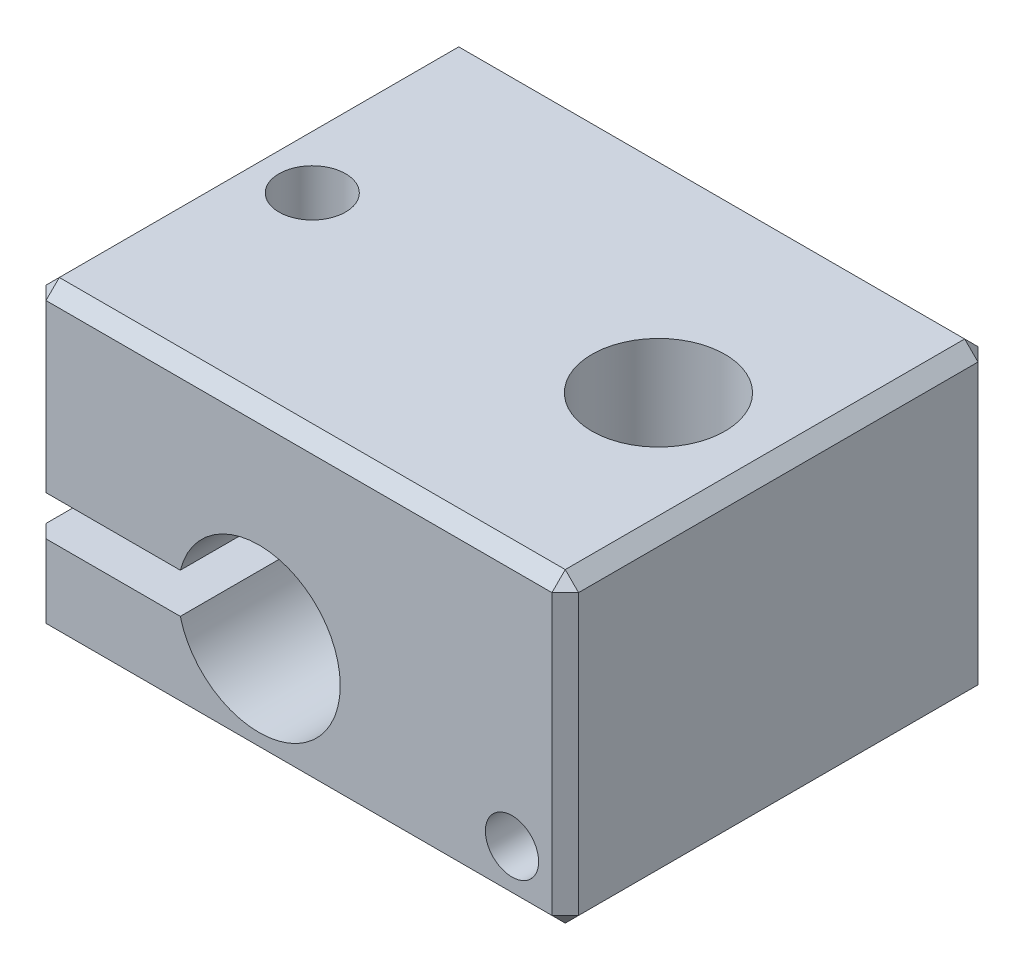
ISO-10303-21;
HEADER;
FILE_DESCRIPTION(('STEP AP214'),'2;1');
FILE_NAME('part.step','',(''),(''),'','','');
FILE_SCHEMA(('AUTOMOTIVE_DESIGN { 1 0 10303 214 1 1 1 1 }'));
ENDSEC;
DATA;
#1=APPLICATION_CONTEXT('core data for automotive mechanical design processes');
#2=APPLICATION_PROTOCOL_DEFINITION('international standard','automotive_design',2000,#1);
#3=PRODUCT_CONTEXT('',#1,'mechanical');
#4=PRODUCT('Part','Part','',(#3));
#5=PRODUCT_RELATED_PRODUCT_CATEGORY('part','',(#4));
#6=PRODUCT_DEFINITION_FORMATION('','',#4);
#7=PRODUCT_DEFINITION_CONTEXT('part definition',#1,'design');
#8=PRODUCT_DEFINITION('design','',#6,#7);
#9=PRODUCT_DEFINITION_SHAPE('','',#8);
#10=(LENGTH_UNIT() NAMED_UNIT(*) SI_UNIT(.MILLI.,.METRE.));
#11=(NAMED_UNIT(*) PLANE_ANGLE_UNIT() SI_UNIT($,.RADIAN.));
#12=(NAMED_UNIT(*) SI_UNIT($,.STERADIAN.) SOLID_ANGLE_UNIT());
#13=UNCERTAINTY_MEASURE_WITH_UNIT(LENGTH_MEASURE(1.E-05),#10,'distance_accuracy_value','');
#14=(GEOMETRIC_REPRESENTATION_CONTEXT(3) GLOBAL_UNCERTAINTY_ASSIGNED_CONTEXT((#13)) GLOBAL_UNIT_ASSIGNED_CONTEXT((#10,
#11,#12)) REPRESENTATION_CONTEXT('',''));
#15=CARTESIAN_POINT('',(0.,0.,0.));
#16=DIRECTION('',(0.,0.,1.));
#17=DIRECTION('',(1.,0.,0.));
#18=AXIS2_PLACEMENT_3D('',#15,#16,#17);
#19=CARTESIAN_POINT('',(0.,11.5,0.));
#20=DIRECTION('',(1.,0.,0.));
#21=DIRECTION('',(0.,0.,-1.));
#22=AXIS2_PLACEMENT_3D('',#19,#20,#21);
#23=PLANE('',#22);
#24=DIRECTION('',(0.,0.,-1.));
#25=VECTOR('',#24,1.);
#26=CARTESIAN_POINT('',(0.,11.,0.));
#27=LINE('',#26,#25);
#28=CARTESIAN_POINT('',(0.,11.,-0.500000000000004));
#29=VERTEX_POINT('',#28);
#30=CARTESIAN_POINT('',(0.,11.,-15.5));
#31=VERTEX_POINT('',#30);
#32=EDGE_CURVE('E297',#29,#31,#27,.T.);
#33=ORIENTED_EDGE('',*,*,#32,.T.);
#34=DIRECTION('',(0.,-1.,0.));
#35=VECTOR('',#34,1.);
#36=CARTESIAN_POINT('',(0.,11.5,-15.5));
#37=LINE('',#36,#35);
#38=CARTESIAN_POINT('',(0.,4.75,-15.5));
#39=VERTEX_POINT('',#38);
#40=EDGE_CURVE('E303',#31,#39,#37,.T.);
#41=ORIENTED_EDGE('',*,*,#40,.T.);
#42=DIRECTION('',(0.,0.,1.));
#43=VECTOR('',#42,1.);
#44=CARTESIAN_POINT('',(0.,4.75,-16.));
#45=LINE('',#44,#43);
#46=CARTESIAN_POINT('',(0.,4.75,-0.500000000000004));
#47=VERTEX_POINT('',#46);
#48=EDGE_CURVE('E242',#39,#47,#45,.T.);
#49=ORIENTED_EDGE('',*,*,#48,.T.);
#50=DIRECTION('',(0.,1.,0.));
#51=VECTOR('',#50,1.);
#52=CARTESIAN_POINT('',(0.,11.5,-0.500000000000004));
#53=LINE('',#52,#51);
#54=EDGE_CURVE('E300',#47,#29,#53,.T.);
#55=ORIENTED_EDGE('',*,*,#54,.T.);
#56=EDGE_LOOP('',(#33,#41,#49,#55));
#57=FACE_BOUND('',#56,.T.);
#58=ADVANCED_FACE('F44',(#57),#23,.F.);
#59=CARTESIAN_POINT('',(2.5,11.5,-8.));
#60=DIRECTION('',(0.,1.,0.));
#61=DIRECTION('',(0.,0.,1.));
#62=AXIS2_PLACEMENT_3D('',#59,#60,#61);
#63=CYLINDRICAL_SURFACE('',#62,1.24999999999999);
#64=CARTESIAN_POINT('',(2.5,11.5,-8.));
#65=DIRECTION('',(0.,1.,0.));
#66=DIRECTION('',(0.,0.,1.));
#67=AXIS2_PLACEMENT_3D('',#64,#65,#66);
#68=CIRCLE('',#67,1.24999999999999);
#69=CARTESIAN_POINT('',(2.5,11.5,-6.75000000000001));
#70=VERTEX_POINT('',#69);
#71=EDGE_CURVE('E257',#70,#70,#68,.T.);
#72=ORIENTED_EDGE('',*,*,#71,.T.);
#73=EDGE_LOOP('',(#72));
#74=FACE_BOUND('',#73,.T.);
#75=CARTESIAN_POINT('',(2.5,4.75,-8.));
#76=DIRECTION('',(0.,-1.,0.));
#77=DIRECTION('',(0.,0.,-1.));
#78=AXIS2_PLACEMENT_3D('',#75,#76,#77);
#79=CIRCLE('',#78,1.24999999999999);
#80=CARTESIAN_POINT('',(2.5,4.75,-9.24999999999999));
#81=VERTEX_POINT('',#80);
#82=EDGE_CURVE('E241',#81,#81,#79,.F.);
#83=ORIENTED_EDGE('',*,*,#82,.F.);
#84=EDGE_LOOP('',(#83));
#85=FACE_BOUND('',#84,.T.);
#86=ADVANCED_FACE('F480',(#74,#85),#63,.F.);
#87=DIRECTION('',(0.,0.,1.));
#88=VECTOR('',#87,1.);
#89=CARTESIAN_POINT('',(0.,3.25,-16.));
#90=LINE('',#89,#88);
#91=CARTESIAN_POINT('',(0.,3.25,-15.5));
#92=VERTEX_POINT('',#91);
#93=CARTESIAN_POINT('',(0.,3.25,-0.500000000000004));
#94=VERTEX_POINT('',#93);
#95=EDGE_CURVE('E237',#92,#94,#90,.T.);
#96=ORIENTED_EDGE('',*,*,#95,.F.);
#97=DIRECTION('',(0.,-1.,0.));
#98=VECTOR('',#97,1.);
#99=CARTESIAN_POINT('',(0.,11.5,-15.5));
#100=LINE('',#99,#98);
#101=CARTESIAN_POINT('',(0.,0.500000000000004,-15.5));
#102=VERTEX_POINT('',#101);
#103=EDGE_CURVE('E277',#92,#102,#100,.T.);
#104=ORIENTED_EDGE('',*,*,#103,.T.);
#105=DIRECTION('',(0.,0.,1.));
#106=VECTOR('',#105,1.);
#107=CARTESIAN_POINT('',(0.,0.500000000000004,0.));
#108=LINE('',#107,#106);
#109=CARTESIAN_POINT('',(0.,0.500000000000004,-0.500000000000004));
#110=VERTEX_POINT('',#109);
#111=EDGE_CURVE('E274',#102,#110,#108,.T.);
#112=ORIENTED_EDGE('',*,*,#111,.T.);
#113=DIRECTION('',(0.,1.,0.));
#114=VECTOR('',#113,1.);
#115=CARTESIAN_POINT('',(0.,11.5,-0.500000000000004));
#116=LINE('',#115,#114);
#117=EDGE_CURVE('E265',#110,#94,#116,.T.);
#118=ORIENTED_EDGE('',*,*,#117,.T.);
#119=EDGE_LOOP('',(#96,#104,#112,#118));
#120=FACE_BOUND('',#119,.T.);
#121=ADVANCED_FACE('F472',(#120),#23,.F.);
#122=CARTESIAN_POINT('',(0.,11.5,0.));
#123=DIRECTION('',(0.,0.,-1.));
#124=DIRECTION('',(-1.,0.,0.));
#125=AXIS2_PLACEMENT_3D('',#122,#123,#124);
#126=PLANE('',#125);
#127=DIRECTION('',(1.,0.,0.));
#128=VECTOR('',#127,1.);
#129=CARTESIAN_POINT('',(0.,3.25,0.));
#130=LINE('',#129,#128);
#131=CARTESIAN_POINT('',(0.500000000000004,3.25,0.));
#132=VERTEX_POINT('',#131);
#133=CARTESIAN_POINT('',(5.5436509001811,3.25,0.));
#134=VERTEX_POINT('',#133);
#135=EDGE_CURVE('E211',#132,#134,#130,.T.);
#136=ORIENTED_EDGE('',*,*,#135,.F.);
#137=DIRECTION('',(0.,-1.,0.));
#138=VECTOR('',#137,1.);
#139=CARTESIAN_POINT('',(0.500000000000004,11.5,0.));
#140=LINE('',#139,#138);
#141=CARTESIAN_POINT('',(0.500000000000004,0.500000000000004,0.));
#142=VERTEX_POINT('',#141);
#143=EDGE_CURVE('E11',#132,#142,#140,.T.);
#144=ORIENTED_EDGE('',*,*,#143,.T.);
#145=DIRECTION('',(1.,0.,0.));
#146=VECTOR('',#145,1.);
#147=CARTESIAN_POINT('',(20.,0.500000000000004,0.));
#148=LINE('',#147,#146);
#149=CARTESIAN_POINT('',(19.5,0.500000000000004,0.));
#150=VERTEX_POINT('',#149);
#151=EDGE_CURVE('E54',#142,#150,#148,.T.);
#152=ORIENTED_EDGE('',*,*,#151,.T.);
#153=DIRECTION('',(0.,1.,0.));
#154=VECTOR('',#153,1.);
#155=CARTESIAN_POINT('',(19.5,11.5,0.));
#156=LINE('',#155,#154);
#157=CARTESIAN_POINT('',(19.5,11.,0.));
#158=VERTEX_POINT('',#157);
#159=EDGE_CURVE('E354',#150,#158,#156,.T.);
#160=ORIENTED_EDGE('',*,*,#159,.T.);
#161=DIRECTION('',(-1.,0.,0.));
#162=VECTOR('',#161,1.);
#163=CARTESIAN_POINT('',(0.,11.,0.));
#164=LINE('',#163,#162);
#165=CARTESIAN_POINT('',(0.500000000000004,11.,0.));
#166=VERTEX_POINT('',#165);
#167=EDGE_CURVE('E348',#158,#166,#164,.T.);
#168=ORIENTED_EDGE('',*,*,#167,.T.);
#169=DIRECTION('',(0.,-1.,0.));
#170=VECTOR('',#169,1.);
#171=CARTESIAN_POINT('',(0.500000000000004,11.5,0.));
#172=LINE('',#171,#170);
#173=CARTESIAN_POINT('',(0.500000000000004,4.75,0.));
#174=VERTEX_POINT('',#173);
#175=EDGE_CURVE('E351',#166,#174,#172,.T.);
#176=ORIENTED_EDGE('',*,*,#175,.T.);
#177=DIRECTION('',(1.,0.,0.));
#178=VECTOR('',#177,1.);
#179=CARTESIAN_POINT('',(0.,4.75,0.));
#180=LINE('',#179,#178);
#181=CARTESIAN_POINT('',(5.5436509001811,4.75,0.));
#182=VERTEX_POINT('',#181);
#183=EDGE_CURVE('E205',#174,#182,#180,.T.);
#184=ORIENTED_EDGE('',*,*,#183,.T.);
#185=CARTESIAN_POINT('',(8.5,4.,0.));
#186=DIRECTION('',(0.,0.,1.));
#187=DIRECTION('',(1.,0.,0.));
#188=AXIS2_PLACEMENT_3D('',#185,#186,#187);
#189=CIRCLE('',#188,3.05);
#190=EDGE_CURVE('E232',#134,#182,#189,.T.);
#191=ORIENTED_EDGE('',*,*,#190,.F.);
#192=EDGE_LOOP('',(#136,#144,#152,#160,#168,#176,#184,#191));
#193=FACE_BOUND('',#192,.T.);
#194=CARTESIAN_POINT('',(18.,2.,0.));
#195=DIRECTION('',(0.,0.,1.));
#196=DIRECTION('',(1.,0.,0.));
#197=AXIS2_PLACEMENT_3D('',#194,#195,#196);
#198=CIRCLE('',#197,1.);
#199=CARTESIAN_POINT('',(19.,2.,0.));
#200=VERTEX_POINT('',#199);
#201=EDGE_CURVE('E459',#200,#200,#198,.T.);
#202=ORIENTED_EDGE('',*,*,#201,.F.);
#203=EDGE_LOOP('',(#202));
#204=FACE_BOUND('',#203,.T.);
#205=ADVANCED_FACE('F469',(#193,#204),#126,.F.);
#206=CARTESIAN_POINT('',(20.,11.5,0.));
#207=DIRECTION('',(-1.,0.,0.));
#208=DIRECTION('',(0.,0.,1.));
#209=AXIS2_PLACEMENT_3D('',#206,#207,#208);
#210=PLANE('',#209);
#211=DIRECTION('',(0.,1.,0.));
#212=VECTOR('',#211,1.);
#213=CARTESIAN_POINT('',(20.,11.5,-15.5));
#214=LINE('',#213,#212);
#215=CARTESIAN_POINT('',(20.,0.500000000000004,-15.5));
#216=VERTEX_POINT('',#215);
#217=CARTESIAN_POINT('',(20.,11.,-15.5));
#218=VERTEX_POINT('',#217);
#219=EDGE_CURVE('E341',#216,#218,#214,.T.);
#220=ORIENTED_EDGE('',*,*,#219,.T.);
#221=DIRECTION('',(0.,0.,1.));
#222=VECTOR('',#221,1.);
#223=CARTESIAN_POINT('',(20.,11.,0.));
#224=LINE('',#223,#222);
#225=CARTESIAN_POINT('',(20.,11.,-0.500000000000004));
#226=VERTEX_POINT('',#225);
#227=EDGE_CURVE('E344',#218,#226,#224,.T.);
#228=ORIENTED_EDGE('',*,*,#227,.T.);
#229=DIRECTION('',(0.,-1.,0.));
#230=VECTOR('',#229,1.);
#231=CARTESIAN_POINT('',(20.,11.5,-0.500000000000004));
#232=LINE('',#231,#230);
#233=CARTESIAN_POINT('',(20.,0.500000000000004,-0.500000000000004));
#234=VERTEX_POINT('',#233);
#235=EDGE_CURVE('E335',#226,#234,#232,.T.);
#236=ORIENTED_EDGE('',*,*,#235,.T.);
#237=DIRECTION('',(0.,0.,-1.));
#238=VECTOR('',#237,1.);
#239=CARTESIAN_POINT('',(20.,0.500000000000004,-16.));
#240=LINE('',#239,#238);
#241=EDGE_CURVE('E338',#234,#216,#240,.T.);
#242=ORIENTED_EDGE('',*,*,#241,.T.);
#243=EDGE_LOOP('',(#220,#228,#236,#242));
#244=FACE_BOUND('',#243,.T.);
#245=ADVANCED_FACE('F471',(#244),#210,.F.);
#246=CARTESIAN_POINT('',(0.,11.5,-16.));
#247=DIRECTION('',(0.,0.,1.));
#248=DIRECTION('',(1.,0.,0.));
#249=AXIS2_PLACEMENT_3D('',#246,#247,#248);
#250=PLANE('',#249);
#251=DIRECTION('',(-1.,0.,0.));
#252=VECTOR('',#251,1.);
#253=CARTESIAN_POINT('',(0.,0.500000000000004,-16.));
#254=LINE('',#253,#252);
#255=CARTESIAN_POINT('',(19.5,0.500000000000004,-16.));
#256=VERTEX_POINT('',#255);
#257=CARTESIAN_POINT('',(0.500000000000004,0.500000000000004,-16.));
#258=VERTEX_POINT('',#257);
#259=EDGE_CURVE('E286',#256,#258,#254,.T.);
#260=ORIENTED_EDGE('',*,*,#259,.T.);
#261=DIRECTION('',(0.,1.,0.));
#262=VECTOR('',#261,1.);
#263=CARTESIAN_POINT('',(0.500000000000004,11.5,-16.));
#264=LINE('',#263,#262);
#265=CARTESIAN_POINT('',(0.500000000000004,3.25,-16.));
#266=VERTEX_POINT('',#265);
#267=EDGE_CURVE('E201',#258,#266,#264,.T.);
#268=ORIENTED_EDGE('',*,*,#267,.T.);
#269=DIRECTION('',(1.,0.,0.));
#270=VECTOR('',#269,1.);
#271=CARTESIAN_POINT('',(0.,3.25,-16.));
#272=LINE('',#271,#270);
#273=CARTESIAN_POINT('',(5.5436509001811,3.25,-16.));
#274=VERTEX_POINT('',#273);
#275=EDGE_CURVE('E194',#266,#274,#272,.T.);
#276=ORIENTED_EDGE('',*,*,#275,.T.);
#277=CARTESIAN_POINT('',(8.5,4.,-16.));
#278=DIRECTION('',(0.,0.,1.));
#279=DIRECTION('',(1.,0.,0.));
#280=AXIS2_PLACEMENT_3D('',#277,#278,#279);
#281=CIRCLE('',#280,3.05);
#282=CARTESIAN_POINT('',(5.5436509001811,4.75,-16.));
#283=VERTEX_POINT('',#282);
#284=EDGE_CURVE('E199',#274,#283,#281,.T.);
#285=ORIENTED_EDGE('',*,*,#284,.T.);
#286=DIRECTION('',(1.,0.,0.));
#287=VECTOR('',#286,1.);
#288=CARTESIAN_POINT('',(0.,4.75,-16.));
#289=LINE('',#288,#287);
#290=CARTESIAN_POINT('',(0.500000000000004,4.75,-16.));
#291=VERTEX_POINT('',#290);
#292=EDGE_CURVE('E217',#291,#283,#289,.T.);
#293=ORIENTED_EDGE('',*,*,#292,.F.);
#294=DIRECTION('',(0.,1.,0.));
#295=VECTOR('',#294,1.);
#296=CARTESIAN_POINT('',(0.500000000000004,11.5,-16.));
#297=LINE('',#296,#295);
#298=CARTESIAN_POINT('',(0.500000000000004,11.,-16.));
#299=VERTEX_POINT('',#298);
#300=EDGE_CURVE('E289',#291,#299,#297,.T.);
#301=ORIENTED_EDGE('',*,*,#300,.T.);
#302=DIRECTION('',(1.,0.,0.));
#303=VECTOR('',#302,1.);
#304=CARTESIAN_POINT('',(0.,11.,-16.));
#305=LINE('',#304,#303);
#306=CARTESIAN_POINT('',(19.5,11.,-16.));
#307=VERTEX_POINT('',#306);
#308=EDGE_CURVE('E280',#299,#307,#305,.T.);
#309=ORIENTED_EDGE('',*,*,#308,.T.);
#310=DIRECTION('',(0.,-1.,0.));
#311=VECTOR('',#310,1.);
#312=CARTESIAN_POINT('',(19.5,11.5,-16.));
#313=LINE('',#312,#311);
#314=EDGE_CURVE('E283',#307,#256,#313,.T.);
#315=ORIENTED_EDGE('',*,*,#314,.T.);
#316=EDGE_LOOP('',(#260,#268,#276,#285,#293,#301,#309,#315));
#317=FACE_BOUND('',#316,.T.);
#318=ADVANCED_FACE('F196',(#317),#250,.F.);
#319=CARTESIAN_POINT('',(0.,11.5,0.));
#320=DIRECTION('',(0.,-1.,0.));
#321=DIRECTION('',(0.,0.,-1.));
#322=AXIS2_PLACEMENT_3D('',#319,#320,#321);
#323=PLANE('',#322);
#324=DIRECTION('',(1.,0.,0.));
#325=VECTOR('',#324,1.);
#326=CARTESIAN_POINT('',(0.,11.5,-0.500000000000004));
#327=LINE('',#326,#325);
#328=CARTESIAN_POINT('',(0.500000000000004,11.5,-0.500000000000004));
#329=VERTEX_POINT('',#328);
#330=CARTESIAN_POINT('',(19.5,11.5,-0.500000000000004));
#331=VERTEX_POINT('',#330);
#332=EDGE_CURVE('E328',#329,#331,#327,.T.);
#333=ORIENTED_EDGE('',*,*,#332,.T.);
#334=DIRECTION('',(0.,0.,-1.));
#335=VECTOR('',#334,1.);
#336=CARTESIAN_POINT('',(19.5,11.5,0.));
#337=LINE('',#336,#335);
#338=CARTESIAN_POINT('',(19.5,11.5,-15.5));
#339=VERTEX_POINT('',#338);
#340=EDGE_CURVE('E331',#331,#339,#337,.T.);
#341=ORIENTED_EDGE('',*,*,#340,.T.);
#342=DIRECTION('',(-1.,0.,0.));
#343=VECTOR('',#342,1.);
#344=CARTESIAN_POINT('',(0.,11.5,-15.5));
#345=LINE('',#344,#343);
#346=CARTESIAN_POINT('',(0.500000000000004,11.5,-15.5));
#347=VERTEX_POINT('',#346);
#348=EDGE_CURVE('E322',#339,#347,#345,.T.);
#349=ORIENTED_EDGE('',*,*,#348,.T.);
#350=DIRECTION('',(0.,0.,1.));
#351=VECTOR('',#350,1.);
#352=CARTESIAN_POINT('',(0.500000000000004,11.5,0.));
#353=LINE('',#352,#351);
#354=EDGE_CURVE('E325',#347,#329,#353,.T.);
#355=ORIENTED_EDGE('',*,*,#354,.T.);
#356=EDGE_LOOP('',(#333,#341,#349,#355));
#357=FACE_BOUND('',#356,.T.);
#358=CARTESIAN_POINT('',(15.5,11.5,-8.));
#359=DIRECTION('',(0.,1.,0.));
#360=DIRECTION('',(0.,0.,1.));
#361=AXIS2_PLACEMENT_3D('',#358,#359,#360);
#362=CIRCLE('',#361,2.49999999999999);
#363=CARTESIAN_POINT('',(15.5,11.5,-5.50000000000001));
#364=VERTEX_POINT('',#363);
#365=EDGE_CURVE('E248',#364,#364,#362,.T.);
#366=ORIENTED_EDGE('',*,*,#365,.F.);
#367=EDGE_LOOP('',(#366));
#368=FACE_BOUND('',#367,.T.);
#369=ORIENTED_EDGE('',*,*,#71,.F.);
#370=EDGE_LOOP('',(#369));
#371=FACE_BOUND('',#370,.T.);
#372=ADVANCED_FACE('F626',(#357,#368,#371),#323,.F.);
#373=CARTESIAN_POINT('',(0.,0.,0.));
#374=DIRECTION('',(0.,-1.,0.));
#375=DIRECTION('',(0.,0.,-1.));
#376=AXIS2_PLACEMENT_3D('',#373,#374,#375);
#377=PLANE('',#376);
#378=DIRECTION('',(-1.,0.,0.));
#379=VECTOR('',#378,1.);
#380=CARTESIAN_POINT('',(0.,0.,-0.500000000000004));
#381=LINE('',#380,#379);
#382=CARTESIAN_POINT('',(19.5,0.,-0.500000000000004));
#383=VERTEX_POINT('',#382);
#384=CARTESIAN_POINT('',(0.500000000000004,0.,-0.500000000000004));
#385=VERTEX_POINT('',#384);
#386=EDGE_CURVE('E309',#383,#385,#381,.T.);
#387=ORIENTED_EDGE('',*,*,#386,.T.);
#388=DIRECTION('',(0.,0.,-1.));
#389=VECTOR('',#388,1.);
#390=CARTESIAN_POINT('',(0.500000000000004,0.,-16.));
#391=LINE('',#390,#389);
#392=CARTESIAN_POINT('',(0.500000000000004,0.,-15.5));
#393=VERTEX_POINT('',#392);
#394=EDGE_CURVE('E318',#385,#393,#391,.T.);
#395=ORIENTED_EDGE('',*,*,#394,.T.);
#396=DIRECTION('',(1.,0.,0.));
#397=VECTOR('',#396,1.);
#398=CARTESIAN_POINT('',(20.,0.,-15.5));
#399=LINE('',#398,#397);
#400=CARTESIAN_POINT('',(19.5,0.,-15.5));
#401=VERTEX_POINT('',#400);
#402=EDGE_CURVE('E315',#393,#401,#399,.T.);
#403=ORIENTED_EDGE('',*,*,#402,.T.);
#404=DIRECTION('',(0.,0.,1.));
#405=VECTOR('',#404,1.);
#406=CARTESIAN_POINT('',(19.5,0.,0.));
#407=LINE('',#406,#405);
#408=EDGE_CURVE('E312',#401,#383,#407,.T.);
#409=ORIENTED_EDGE('',*,*,#408,.T.);
#410=EDGE_LOOP('',(#387,#395,#403,#409));
#411=FACE_BOUND('',#410,.T.);
#412=CARTESIAN_POINT('',(15.5,0.,-8.));
#413=DIRECTION('',(0.,1.,0.));
#414=DIRECTION('',(0.,0.,1.));
#415=AXIS2_PLACEMENT_3D('',#412,#413,#414);
#416=CIRCLE('',#415,2.5);
#417=CARTESIAN_POINT('',(15.5,0.,-5.50000000000001));
#418=VERTEX_POINT('',#417);
#419=EDGE_CURVE('E252',#418,#418,#416,.T.);
#420=ORIENTED_EDGE('',*,*,#419,.T.);
#421=EDGE_LOOP('',(#420));
#422=FACE_BOUND('',#421,.T.);
#423=CARTESIAN_POINT('',(2.5,0.,-8.));
#424=DIRECTION('',(0.,1.,0.));
#425=DIRECTION('',(0.,0.,1.));
#426=AXIS2_PLACEMENT_3D('',#423,#424,#425);
#427=CIRCLE('',#426,1.25);
#428=CARTESIAN_POINT('',(2.5,0.,-6.75));
#429=VERTEX_POINT('',#428);
#430=EDGE_CURVE('E261',#429,#429,#427,.T.);
#431=ORIENTED_EDGE('',*,*,#430,.T.);
#432=EDGE_LOOP('',(#431));
#433=FACE_BOUND('',#432,.T.);
#434=ADVANCED_FACE('F629',(#411,#422,#433),#377,.T.);
#435=CARTESIAN_POINT('',(2.5,3.25,-8.));
#436=DIRECTION('',(0.,-1.,0.));
#437=DIRECTION('',(0.,0.,-1.));
#438=AXIS2_PLACEMENT_3D('',#435,#436,#437);
#439=CIRCLE('',#438,1.24999999999999);
#440=CARTESIAN_POINT('',(2.5,3.25,-9.24999999999999));
#441=VERTEX_POINT('',#440);
#442=EDGE_CURVE('E253',#441,#441,#439,.F.);
#443=ORIENTED_EDGE('',*,*,#442,.T.);
#444=EDGE_LOOP('',(#443));
#445=FACE_BOUND('',#444,.T.);
#446=ORIENTED_EDGE('',*,*,#430,.F.);
#447=EDGE_LOOP('',(#446));
#448=FACE_BOUND('',#447,.T.);
#449=ADVANCED_FACE('F490',(#445,#448),#63,.F.);
#450=CARTESIAN_POINT('',(15.5,11.5,-8.));
#451=DIRECTION('',(0.,1.,0.));
#452=DIRECTION('',(0.,0.,1.));
#453=AXIS2_PLACEMENT_3D('',#450,#451,#452);
#454=CYLINDRICAL_SURFACE('',#453,2.49999999999999);
#455=ORIENTED_EDGE('',*,*,#419,.F.);
#456=EDGE_LOOP('',(#455));
#457=FACE_BOUND('',#456,.T.);
#458=ORIENTED_EDGE('',*,*,#365,.T.);
#459=EDGE_LOOP('',(#458));
#460=FACE_BOUND('',#459,.T.);
#461=ADVANCED_FACE('F643',(#457,#460),#454,.F.);
#462=CARTESIAN_POINT('',(0.,3.25,-16.));
#463=DIRECTION('',(0.,-1.,0.));
#464=DIRECTION('',(0.,0.,-1.));
#465=AXIS2_PLACEMENT_3D('',#462,#463,#464);
#466=PLANE('',#465);
#467=ORIENTED_EDGE('',*,*,#275,.F.);
#468=DIRECTION('',(0.707106781186548,0.,-0.707106781186548));
#469=VECTOR('',#468,1.);
#470=CARTESIAN_POINT('',(0.,3.25,-15.5));
#471=LINE('',#470,#469);
#472=EDGE_CURVE('E295',#266,#92,#471,.F.);
#473=ORIENTED_EDGE('',*,*,#472,.T.);
#474=ORIENTED_EDGE('',*,*,#95,.T.);
#475=DIRECTION('',(-0.707106781186548,0.,-0.707106781186548));
#476=VECTOR('',#475,1.);
#477=CARTESIAN_POINT('',(0.500000000000004,3.25,0.));
#478=LINE('',#477,#476);
#479=EDGE_CURVE('E292',#94,#132,#478,.F.);
#480=ORIENTED_EDGE('',*,*,#479,.T.);
#481=ORIENTED_EDGE('',*,*,#135,.T.);
#482=DIRECTION('',(0.,0.,1.));
#483=VECTOR('',#482,1.);
#484=CARTESIAN_POINT('',(5.5436509001811,3.25,-16.));
#485=LINE('',#484,#483);
#486=EDGE_CURVE('E208',#274,#134,#485,.T.);
#487=ORIENTED_EDGE('',*,*,#486,.F.);
#488=EDGE_LOOP('',(#467,#473,#474,#480,#481,#487));
#489=FACE_BOUND('',#488,.T.);
#490=ORIENTED_EDGE('',*,*,#442,.F.);
#491=EDGE_LOOP('',(#490));
#492=FACE_BOUND('',#491,.T.);
#493=ADVANCED_FACE('F209',(#489,#492),#466,.F.);
#494=CARTESIAN_POINT('',(0.,4.75,-16.));
#495=DIRECTION('',(0.,-1.,0.));
#496=DIRECTION('',(0.,0.,-1.));
#497=AXIS2_PLACEMENT_3D('',#494,#495,#496);
#498=PLANE('',#497);
#499=ORIENTED_EDGE('',*,*,#48,.F.);
#500=DIRECTION('',(-0.707106781186548,0.,0.707106781186548));
#501=VECTOR('',#500,1.);
#502=CARTESIAN_POINT('',(0.250000000000002,4.75,-15.75));
#503=LINE('',#502,#501);
#504=EDGE_CURVE('E307',#39,#291,#503,.F.);
#505=ORIENTED_EDGE('',*,*,#504,.T.);
#506=ORIENTED_EDGE('',*,*,#292,.T.);
#507=DIRECTION('',(0.,0.,1.));
#508=VECTOR('',#507,1.);
#509=CARTESIAN_POINT('',(5.5436509001811,4.75,-16.));
#510=LINE('',#509,#508);
#511=EDGE_CURVE('E216',#283,#182,#510,.T.);
#512=ORIENTED_EDGE('',*,*,#511,.T.);
#513=ORIENTED_EDGE('',*,*,#183,.F.);
#514=DIRECTION('',(0.707106781186548,0.,0.707106781186548));
#515=VECTOR('',#514,1.);
#516=CARTESIAN_POINT('',(-7.75,4.75,-8.25));
#517=LINE('',#516,#515);
#518=EDGE_CURVE('E305',#174,#47,#517,.F.);
#519=ORIENTED_EDGE('',*,*,#518,.T.);
#520=EDGE_LOOP('',(#499,#505,#506,#512,#513,#519));
#521=FACE_BOUND('',#520,.T.);
#522=ORIENTED_EDGE('',*,*,#82,.T.);
#523=EDGE_LOOP('',(#522));
#524=FACE_BOUND('',#523,.T.);
#525=ADVANCED_FACE('F588',(#521,#524),#498,.T.);
#526=CARTESIAN_POINT('',(8.5,4.,-16.));
#527=DIRECTION('',(0.,0.,1.));
#528=DIRECTION('',(1.,0.,0.));
#529=AXIS2_PLACEMENT_3D('',#526,#527,#528);
#530=CYLINDRICAL_SURFACE('',#529,3.05);
#531=ORIENTED_EDGE('',*,*,#190,.T.);
#532=ORIENTED_EDGE('',*,*,#511,.F.);
#533=ORIENTED_EDGE('',*,*,#284,.F.);
#534=ORIENTED_EDGE('',*,*,#486,.T.);
#535=EDGE_LOOP('',(#531,#532,#533,#534));
#536=FACE_BOUND('',#535,.T.);
#537=ADVANCED_FACE('F220',(#536),#530,.F.);
#538=CARTESIAN_POINT('',(18.,2.,-2.));
#539=DIRECTION('',(0.,0.,1.));
#540=DIRECTION('',(1.,0.,0.));
#541=AXIS2_PLACEMENT_3D('',#538,#539,#540);
#542=CYLINDRICAL_SURFACE('',#541,1.);
#543=CARTESIAN_POINT('',(18.,2.,-2.));
#544=DIRECTION('',(0.,0.,1.));
#545=DIRECTION('',(1.,0.,0.));
#546=AXIS2_PLACEMENT_3D('',#543,#544,#545);
#547=CIRCLE('',#546,1.);
#548=CARTESIAN_POINT('',(19.,2.,-2.));
#549=VERTEX_POINT('',#548);
#550=EDGE_CURVE('E233',#549,#549,#547,.T.);
#551=ORIENTED_EDGE('',*,*,#550,.F.);
#552=EDGE_LOOP('',(#551));
#553=FACE_BOUND('',#552,.T.);
#554=ORIENTED_EDGE('',*,*,#201,.T.);
#555=EDGE_LOOP('',(#554));
#556=FACE_BOUND('',#555,.T.);
#557=ADVANCED_FACE('F467',(#553,#556),#542,.F.);
#558=CARTESIAN_POINT('',(18.,2.,-2.));
#559=DIRECTION('',(0.,0.,1.));
#560=DIRECTION('',(1.,0.,0.));
#561=AXIS2_PLACEMENT_3D('',#558,#559,#560);
#562=PLANE('',#561);
#563=CARTESIAN_POINT('',(18.,2.,-2.));
#564=DIRECTION('',(0.,0.,1.));
#565=DIRECTION('',(1.,0.,0.));
#566=AXIS2_PLACEMENT_3D('',#563,#564,#565);
#567=CIRCLE('',#566,0.750000000000002);
#568=CARTESIAN_POINT('',(18.75,2.,-2.));
#569=VERTEX_POINT('',#568);
#570=EDGE_CURVE('E446',#569,#569,#567,.T.);
#571=ORIENTED_EDGE('',*,*,#570,.F.);
#572=EDGE_LOOP('',(#571));
#573=FACE_BOUND('',#572,.T.);
#574=ORIENTED_EDGE('',*,*,#550,.T.);
#575=EDGE_LOOP('',(#574));
#576=FACE_BOUND('',#575,.T.);
#577=ADVANCED_FACE('F829',(#573,#576),#562,.T.);
#578=CARTESIAN_POINT('',(18.,2.,-4.5));
#579=DIRECTION('',(0.,0.,1.));
#580=DIRECTION('',(1.,0.,0.));
#581=AXIS2_PLACEMENT_3D('',#578,#579,#580);
#582=CYLINDRICAL_SURFACE('',#581,0.750000000000002);
#583=CARTESIAN_POINT('',(18.,2.,-4.5));
#584=DIRECTION('',(0.,0.,1.));
#585=DIRECTION('',(1.,0.,0.));
#586=AXIS2_PLACEMENT_3D('',#583,#584,#585);
#587=CIRCLE('',#586,0.750000000000002);
#588=CARTESIAN_POINT('',(18.75,2.,-4.5));
#589=VERTEX_POINT('',#588);
#590=EDGE_CURVE('E452',#589,#589,#587,.T.);
#591=ORIENTED_EDGE('',*,*,#590,.F.);
#592=EDGE_LOOP('',(#591));
#593=FACE_BOUND('',#592,.T.);
#594=ORIENTED_EDGE('',*,*,#570,.T.);
#595=EDGE_LOOP('',(#594));
#596=FACE_BOUND('',#595,.T.);
#597=ADVANCED_FACE('F840',(#593,#596),#582,.F.);
#598=CARTESIAN_POINT('',(18.,2.,-4.5));
#599=DIRECTION('',(0.,0.,1.));
#600=DIRECTION('',(1.,0.,0.));
#601=AXIS2_PLACEMENT_3D('',#598,#599,#600);
#602=PLANE('',#601);
#603=ORIENTED_EDGE('',*,*,#590,.T.);
#604=EDGE_LOOP('',(#603));
#605=FACE_BOUND('',#604,.T.);
#606=ADVANCED_FACE('F575',(#605),#602,.T.);
#607=CARTESIAN_POINT('',(0.500000000000004,11.5,0.));
#608=DIRECTION('',(0.707106781186547,0.,-0.707106781186547));
#609=DIRECTION('',(0.,-1.,0.));
#610=AXIS2_PLACEMENT_3D('',#607,#608,#609);
#611=PLANE('',#610);
#612=DIRECTION('',(-0.707106781186547,0.,-0.707106781186547));
#613=VECTOR('',#612,1.);
#614=CARTESIAN_POINT('',(0.,11.,-0.500000000000004));
#615=LINE('',#614,#613);
#616=EDGE_CURVE('E48',#29,#166,#615,.F.);
#617=ORIENTED_EDGE('',*,*,#616,.F.);
#618=ORIENTED_EDGE('',*,*,#54,.F.);
#619=ORIENTED_EDGE('',*,*,#518,.F.);
#620=ORIENTED_EDGE('',*,*,#175,.F.);
#621=EDGE_LOOP('',(#617,#618,#619,#620));
#622=FACE_BOUND('',#621,.T.);
#623=ADVANCED_FACE('F46',(#622),#611,.F.);
#624=CARTESIAN_POINT('',(0.,11.,-0.500000000000004));
#625=DIRECTION('',(-0.577350269189626,0.577350269189626,0.577350269189626));
#626=DIRECTION('',(0.707106781186547,0.,0.707106781186547));
#627=AXIS2_PLACEMENT_3D('',#624,#625,#626);
#628=PLANE('',#627);
#629=DIRECTION('',(0.707106781186547,0.707106781186547,0.));
#630=VECTOR('',#629,1.);
#631=CARTESIAN_POINT('',(0.,11.,-0.500000000000004));
#632=LINE('',#631,#630);
#633=EDGE_CURVE('E434',#29,#329,#632,.T.);
#634=ORIENTED_EDGE('',*,*,#633,.F.);
#635=ORIENTED_EDGE('',*,*,#616,.T.);
#636=DIRECTION('',(0.,-0.707106781186547,0.707106781186547));
#637=VECTOR('',#636,1.);
#638=CARTESIAN_POINT('',(0.500000000000004,11.25,-0.250000000000002));
#639=LINE('',#638,#637);
#640=EDGE_CURVE('E437',#329,#166,#639,.T.);
#641=ORIENTED_EDGE('',*,*,#640,.F.);
#642=EDGE_LOOP('',(#634,#635,#641));
#643=FACE_BOUND('',#642,.T.);
#644=ADVANCED_FACE('F570',(#643),#628,.T.);
#645=CARTESIAN_POINT('',(0.,11.5,-0.500000000000004));
#646=DIRECTION('',(0.,-0.707106781186547,-0.707106781186547));
#647=DIRECTION('',(1.,0.,0.));
#648=AXIS2_PLACEMENT_3D('',#645,#646,#647);
#649=PLANE('',#648);
#650=ORIENTED_EDGE('',*,*,#640,.T.);
#651=ORIENTED_EDGE('',*,*,#167,.F.);
#652=DIRECTION('',(0.,0.707106781186547,-0.707106781186547));
#653=VECTOR('',#652,1.);
#654=CARTESIAN_POINT('',(19.5,11.25,-0.250000000000002));
#655=LINE('',#654,#653);
#656=EDGE_CURVE('E430',#331,#158,#655,.F.);
#657=ORIENTED_EDGE('',*,*,#656,.F.);
#658=ORIENTED_EDGE('',*,*,#332,.F.);
#659=EDGE_LOOP('',(#650,#651,#657,#658));
#660=FACE_BOUND('',#659,.T.);
#661=ADVANCED_FACE('F567',(#660),#649,.F.);
#662=CARTESIAN_POINT('',(0.500000000000004,11.5,0.));
#663=DIRECTION('',(0.707106781186547,-0.707106781186547,0.));
#664=DIRECTION('',(0.,0.,1.));
#665=AXIS2_PLACEMENT_3D('',#662,#663,#664);
#666=PLANE('',#665);
#667=ORIENTED_EDGE('',*,*,#633,.T.);
#668=ORIENTED_EDGE('',*,*,#354,.F.);
#669=DIRECTION('',(-0.707106781186547,-0.707106781186547,0.));
#670=VECTOR('',#669,1.);
#671=CARTESIAN_POINT('',(0.250000000000002,11.25,-15.5));
#672=LINE('',#671,#670);
#673=EDGE_CURVE('E427',#31,#347,#672,.F.);
#674=ORIENTED_EDGE('',*,*,#673,.F.);
#675=ORIENTED_EDGE('',*,*,#32,.F.);
#676=EDGE_LOOP('',(#667,#668,#674,#675));
#677=FACE_BOUND('',#676,.T.);
#678=ADVANCED_FACE('F563',(#677),#666,.F.);
#679=CARTESIAN_POINT('',(0.,11.5,-15.5));
#680=DIRECTION('',(0.707106781186547,0.,0.707106781186547));
#681=DIRECTION('',(0.,-1.,0.));
#682=AXIS2_PLACEMENT_3D('',#679,#680,#681);
#683=PLANE('',#682);
#684=ORIENTED_EDGE('',*,*,#504,.F.);
#685=ORIENTED_EDGE('',*,*,#40,.F.);
#686=DIRECTION('',(0.707106781186547,0.,-0.707106781186547));
#687=VECTOR('',#686,1.);
#688=CARTESIAN_POINT('',(0.500000000000004,11.,-16.));
#689=LINE('',#688,#687);
#690=EDGE_CURVE('E424',#299,#31,#689,.F.);
#691=ORIENTED_EDGE('',*,*,#690,.F.);
#692=ORIENTED_EDGE('',*,*,#300,.F.);
#693=EDGE_LOOP('',(#684,#685,#691,#692));
#694=FACE_BOUND('',#693,.T.);
#695=ADVANCED_FACE('F559',(#694),#683,.F.);
#696=CARTESIAN_POINT('',(20.,11.,-0.500000000000004));
#697=DIRECTION('',(0.577350269189626,0.577350269189626,0.577350269189626));
#698=DIRECTION('',(0.707106781186547,0.,-0.707106781186547));
#699=AXIS2_PLACEMENT_3D('',#696,#697,#698);
#700=PLANE('',#699);
#701=DIRECTION('',(0.707106781186547,-0.707106781186547,0.));
#702=VECTOR('',#701,1.);
#703=CARTESIAN_POINT('',(20.,11.,-0.500000000000004));
#704=LINE('',#703,#702);
#705=EDGE_CURVE('E416',#331,#226,#704,.T.);
#706=ORIENTED_EDGE('',*,*,#705,.F.);
#707=ORIENTED_EDGE('',*,*,#656,.T.);
#708=DIRECTION('',(-0.707106781186547,0.,0.707106781186547));
#709=VECTOR('',#708,1.);
#710=CARTESIAN_POINT('',(20.,11.,-0.500000000000004));
#711=LINE('',#710,#709);
#712=EDGE_CURVE('E420',#226,#158,#711,.T.);
#713=ORIENTED_EDGE('',*,*,#712,.F.);
#714=EDGE_LOOP('',(#706,#707,#713));
#715=FACE_BOUND('',#714,.T.);
#716=ADVANCED_FACE('F555',(#715),#700,.T.);
#717=CARTESIAN_POINT('',(0.500000000000004,11.,-16.));
#718=DIRECTION('',(-0.577350269189626,0.577350269189626,-0.577350269189626));
#719=DIRECTION('',(-0.707106781186547,0.,0.707106781186547));
#720=AXIS2_PLACEMENT_3D('',#717,#718,#719);
#721=PLANE('',#720);
#722=ORIENTED_EDGE('',*,*,#690,.T.);
#723=ORIENTED_EDGE('',*,*,#673,.T.);
#724=DIRECTION('',(0.,0.707106781186547,0.707106781186547));
#725=VECTOR('',#724,1.);
#726=CARTESIAN_POINT('',(0.500000000000004,11.,-16.));
#727=LINE('',#726,#725);
#728=EDGE_CURVE('E413',#299,#347,#727,.T.);
#729=ORIENTED_EDGE('',*,*,#728,.F.);
#730=EDGE_LOOP('',(#722,#723,#729));
#731=FACE_BOUND('',#730,.T.);
#732=ADVANCED_FACE('F551',(#731),#721,.T.);
#733=CARTESIAN_POINT('',(20.,11.5,-0.500000000000004));
#734=DIRECTION('',(-0.707106781186547,0.,-0.707106781186547));
#735=DIRECTION('',(0.,-1.,0.));
#736=AXIS2_PLACEMENT_3D('',#733,#734,#735);
#737=PLANE('',#736);
#738=ORIENTED_EDGE('',*,*,#712,.T.);
#739=ORIENTED_EDGE('',*,*,#159,.F.);
#740=DIRECTION('',(0.707106781186547,0.,-0.707106781186547));
#741=VECTOR('',#740,1.);
#742=CARTESIAN_POINT('',(19.75,0.500000000000004,-0.250000000000002));
#743=LINE('',#742,#741);
#744=EDGE_CURVE('E409',#234,#150,#743,.F.);
#745=ORIENTED_EDGE('',*,*,#744,.F.);
#746=ORIENTED_EDGE('',*,*,#235,.F.);
#747=EDGE_LOOP('',(#738,#739,#745,#746));
#748=FACE_BOUND('',#747,.T.);
#749=ADVANCED_FACE('F547',(#748),#737,.F.);
#750=CARTESIAN_POINT('',(19.5,11.5,0.));
#751=DIRECTION('',(-0.707106781186547,-0.707106781186547,0.));
#752=DIRECTION('',(0.,0.,-1.));
#753=AXIS2_PLACEMENT_3D('',#750,#751,#752);
#754=PLANE('',#753);
#755=ORIENTED_EDGE('',*,*,#705,.T.);
#756=ORIENTED_EDGE('',*,*,#227,.F.);
#757=DIRECTION('',(-0.707106781186547,0.707106781186547,0.));
#758=VECTOR('',#757,1.);
#759=CARTESIAN_POINT('',(19.5,11.5,-15.5));
#760=LINE('',#759,#758);
#761=EDGE_CURVE('E405',#339,#218,#760,.F.);
#762=ORIENTED_EDGE('',*,*,#761,.F.);
#763=ORIENTED_EDGE('',*,*,#340,.F.);
#764=EDGE_LOOP('',(#755,#756,#762,#763));
#765=FACE_BOUND('',#764,.T.);
#766=ADVANCED_FACE('F543',(#765),#754,.F.);
#767=CARTESIAN_POINT('',(0.,11.5,-15.5));
#768=DIRECTION('',(0.,-0.707106781186547,0.707106781186547));
#769=DIRECTION('',(-1.,0.,0.));
#770=AXIS2_PLACEMENT_3D('',#767,#768,#769);
#771=PLANE('',#770);
#772=ORIENTED_EDGE('',*,*,#728,.T.);
#773=ORIENTED_EDGE('',*,*,#348,.F.);
#774=DIRECTION('',(0.,-0.707106781186547,-0.707106781186547));
#775=VECTOR('',#774,1.);
#776=CARTESIAN_POINT('',(19.5,11.5,-15.5));
#777=LINE('',#776,#775);
#778=EDGE_CURVE('E402',#307,#339,#777,.F.);
#779=ORIENTED_EDGE('',*,*,#778,.F.);
#780=ORIENTED_EDGE('',*,*,#308,.F.);
#781=EDGE_LOOP('',(#772,#773,#779,#780));
#782=FACE_BOUND('',#781,.T.);
#783=ADVANCED_FACE('F539',(#782),#771,.F.);
#784=CARTESIAN_POINT('',(19.5,0.,-0.500000000000004));
#785=DIRECTION('',(0.577350269189626,-0.577350269189626,0.577350269189626));
#786=DIRECTION('',(0.707106781186547,0.,-0.707106781186547));
#787=AXIS2_PLACEMENT_3D('',#784,#785,#786);
#788=PLANE('',#787);
#789=DIRECTION('',(0.707106781186547,0.707106781186547,0.));
#790=VECTOR('',#789,1.);
#791=CARTESIAN_POINT('',(19.5,0.,-0.500000000000004));
#792=LINE('',#791,#790);
#793=EDGE_CURVE('E394',#234,#383,#792,.F.);
#794=ORIENTED_EDGE('',*,*,#793,.F.);
#795=ORIENTED_EDGE('',*,*,#744,.T.);
#796=DIRECTION('',(0.,-0.707106781186547,-0.707106781186547));
#797=VECTOR('',#796,1.);
#798=CARTESIAN_POINT('',(19.5,0.,-0.500000000000004));
#799=LINE('',#798,#797);
#800=EDGE_CURVE('E398',#383,#150,#799,.F.);
#801=ORIENTED_EDGE('',*,*,#800,.F.);
#802=EDGE_LOOP('',(#794,#795,#801));
#803=FACE_BOUND('',#802,.T.);
#804=ADVANCED_FACE('F535',(#803),#788,.T.);
#805=CARTESIAN_POINT('',(19.5,11.5,-15.5));
#806=DIRECTION('',(0.577350269189626,0.577350269189626,-0.577350269189626));
#807=DIRECTION('',(-0.707106781186547,0.,-0.707106781186547));
#808=AXIS2_PLACEMENT_3D('',#805,#806,#807);
#809=PLANE('',#808);
#810=ORIENTED_EDGE('',*,*,#778,.T.);
#811=ORIENTED_EDGE('',*,*,#761,.T.);
#812=DIRECTION('',(0.707106781186547,0.,0.707106781186547));
#813=VECTOR('',#812,1.);
#814=CARTESIAN_POINT('',(19.75,11.,-15.75));
#815=LINE('',#814,#813);
#816=EDGE_CURVE('E390',#307,#218,#815,.T.);
#817=ORIENTED_EDGE('',*,*,#816,.F.);
#818=EDGE_LOOP('',(#810,#811,#817));
#819=FACE_BOUND('',#818,.T.);
#820=ADVANCED_FACE('F531',(#819),#809,.T.);
#821=CARTESIAN_POINT('',(0.500000000000004,11.5,0.));
#822=DIRECTION('',(0.707106781186547,0.,-0.707106781186547));
#823=DIRECTION('',(0.,-1.,0.));
#824=AXIS2_PLACEMENT_3D('',#821,#822,#823);
#825=PLANE('',#824);
#826=ORIENTED_EDGE('',*,*,#479,.F.);
#827=ORIENTED_EDGE('',*,*,#117,.F.);
#828=DIRECTION('',(0.707106781186547,0.,0.707106781186547));
#829=VECTOR('',#828,1.);
#830=CARTESIAN_POINT('',(0.,0.500000000000004,-0.500000000000004));
#831=LINE('',#830,#829);
#832=EDGE_CURVE('E386',#142,#110,#831,.F.);
#833=ORIENTED_EDGE('',*,*,#832,.F.);
#834=ORIENTED_EDGE('',*,*,#143,.F.);
#835=EDGE_LOOP('',(#826,#827,#833,#834));
#836=FACE_BOUND('',#835,.T.);
#837=ADVANCED_FACE('F527',(#836),#825,.F.);
#838=CARTESIAN_POINT('',(0.,0.500000000000004,0.));
#839=DIRECTION('',(0.,-0.707106781186547,0.707106781186547));
#840=DIRECTION('',(-1.,0.,0.));
#841=AXIS2_PLACEMENT_3D('',#838,#839,#840);
#842=PLANE('',#841);
#843=ORIENTED_EDGE('',*,*,#800,.T.);
#844=ORIENTED_EDGE('',*,*,#151,.F.);
#845=DIRECTION('',(0.,0.707106781186547,0.707106781186547));
#846=VECTOR('',#845,1.);
#847=CARTESIAN_POINT('',(0.500000000000004,0.250000000000002,-0.250000000000002));
#848=LINE('',#847,#846);
#849=EDGE_CURVE('E382',#385,#142,#848,.T.);
#850=ORIENTED_EDGE('',*,*,#849,.F.);
#851=ORIENTED_EDGE('',*,*,#386,.F.);
#852=EDGE_LOOP('',(#843,#844,#850,#851));
#853=FACE_BOUND('',#852,.T.);
#854=ADVANCED_FACE('F523',(#853),#842,.T.);
#855=CARTESIAN_POINT('',(20.,0.500000000000004,0.));
#856=DIRECTION('',(0.707106781186547,-0.707106781186547,0.));
#857=DIRECTION('',(0.,0.,1.));
#858=AXIS2_PLACEMENT_3D('',#855,#856,#857);
#859=PLANE('',#858);
#860=ORIENTED_EDGE('',*,*,#793,.T.);
#861=ORIENTED_EDGE('',*,*,#408,.F.);
#862=DIRECTION('',(-0.707106781186547,-0.707106781186547,0.));
#863=VECTOR('',#862,1.);
#864=CARTESIAN_POINT('',(19.5,0.,-15.5));
#865=LINE('',#864,#863);
#866=EDGE_CURVE('E378',#216,#401,#865,.T.);
#867=ORIENTED_EDGE('',*,*,#866,.F.);
#868=ORIENTED_EDGE('',*,*,#241,.F.);
#869=EDGE_LOOP('',(#860,#861,#867,#868));
#870=FACE_BOUND('',#869,.T.);
#871=ADVANCED_FACE('F519',(#870),#859,.T.);
#872=CARTESIAN_POINT('',(19.5,11.5,-16.));
#873=DIRECTION('',(-0.707106781186547,0.,0.707106781186547));
#874=DIRECTION('',(0.,-1.,0.));
#875=AXIS2_PLACEMENT_3D('',#872,#873,#874);
#876=PLANE('',#875);
#877=ORIENTED_EDGE('',*,*,#816,.T.);
#878=ORIENTED_EDGE('',*,*,#219,.F.);
#879=DIRECTION('',(-0.707106781186547,0.,-0.707106781186547));
#880=VECTOR('',#879,1.);
#881=CARTESIAN_POINT('',(19.75,0.500000000000004,-15.75));
#882=LINE('',#881,#880);
#883=EDGE_CURVE('E374',#256,#216,#882,.F.);
#884=ORIENTED_EDGE('',*,*,#883,.F.);
#885=ORIENTED_EDGE('',*,*,#314,.F.);
#886=EDGE_LOOP('',(#877,#878,#884,#885));
#887=FACE_BOUND('',#886,.T.);
#888=ADVANCED_FACE('F515',(#887),#876,.F.);
#889=CARTESIAN_POINT('',(0.,0.500000000000004,-0.500000000000004));
#890=DIRECTION('',(-0.577350269189626,-0.577350269189626,0.577350269189626));
#891=DIRECTION('',(0.707106781186547,0.,0.707106781186547));
#892=AXIS2_PLACEMENT_3D('',#889,#890,#891);
#893=PLANE('',#892);
#894=ORIENTED_EDGE('',*,*,#849,.T.);
#895=ORIENTED_EDGE('',*,*,#832,.T.);
#896=DIRECTION('',(0.707106781186547,-0.707106781186547,0.));
#897=VECTOR('',#896,1.);
#898=CARTESIAN_POINT('',(0.,0.500000000000004,-0.500000000000004));
#899=LINE('',#898,#897);
#900=EDGE_CURVE('E370',#385,#110,#899,.F.);
#901=ORIENTED_EDGE('',*,*,#900,.F.);
#902=EDGE_LOOP('',(#894,#895,#901));
#903=FACE_BOUND('',#902,.T.);
#904=ADVANCED_FACE('F511',(#903),#893,.T.);
#905=CARTESIAN_POINT('',(19.5,0.,-15.5));
#906=DIRECTION('',(0.577350269189626,-0.577350269189626,-0.577350269189626));
#907=DIRECTION('',(-0.707106781186547,0.,-0.707106781186547));
#908=AXIS2_PLACEMENT_3D('',#905,#906,#907);
#909=PLANE('',#908);
#910=ORIENTED_EDGE('',*,*,#883,.T.);
#911=ORIENTED_EDGE('',*,*,#866,.T.);
#912=DIRECTION('',(0.,0.707106781186547,-0.707106781186547));
#913=VECTOR('',#912,1.);
#914=CARTESIAN_POINT('',(19.5,0.,-15.5));
#915=LINE('',#914,#913);
#916=EDGE_CURVE('E366',#256,#401,#915,.F.);
#917=ORIENTED_EDGE('',*,*,#916,.F.);
#918=EDGE_LOOP('',(#910,#911,#917));
#919=FACE_BOUND('',#918,.T.);
#920=ADVANCED_FACE('F507',(#919),#909,.T.);
#921=CARTESIAN_POINT('',(0.,0.500000000000004,0.));
#922=DIRECTION('',(-0.707106781186547,-0.707106781186547,0.));
#923=DIRECTION('',(0.,0.,-1.));
#924=AXIS2_PLACEMENT_3D('',#921,#922,#923);
#925=PLANE('',#924);
#926=ORIENTED_EDGE('',*,*,#900,.T.);
#927=ORIENTED_EDGE('',*,*,#111,.F.);
#928=DIRECTION('',(-0.707106781186547,0.707106781186547,0.));
#929=VECTOR('',#928,1.);
#930=CARTESIAN_POINT('',(0.,0.500000000000004,-15.5));
#931=LINE('',#930,#929);
#932=EDGE_CURVE('E363',#393,#102,#931,.T.);
#933=ORIENTED_EDGE('',*,*,#932,.F.);
#934=ORIENTED_EDGE('',*,*,#394,.F.);
#935=EDGE_LOOP('',(#926,#927,#933,#934));
#936=FACE_BOUND('',#935,.T.);
#937=ADVANCED_FACE('F503',(#936),#925,.T.);
#938=CARTESIAN_POINT('',(0.,0.500000000000004,-16.));
#939=DIRECTION('',(0.,-0.707106781186547,-0.707106781186547));
#940=DIRECTION('',(1.,0.,0.));
#941=AXIS2_PLACEMENT_3D('',#938,#939,#940);
#942=PLANE('',#941);
#943=ORIENTED_EDGE('',*,*,#916,.T.);
#944=ORIENTED_EDGE('',*,*,#402,.F.);
#945=DIRECTION('',(0.,-0.707106781186547,0.707106781186547));
#946=VECTOR('',#945,1.);
#947=CARTESIAN_POINT('',(0.500000000000004,0.250000000000002,-15.75));
#948=LINE('',#947,#946);
#949=EDGE_CURVE('E361',#258,#393,#948,.T.);
#950=ORIENTED_EDGE('',*,*,#949,.F.);
#951=ORIENTED_EDGE('',*,*,#259,.F.);
#952=EDGE_LOOP('',(#943,#944,#950,#951));
#953=FACE_BOUND('',#952,.T.);
#954=ADVANCED_FACE('F499',(#953),#942,.T.);
#955=CARTESIAN_POINT('',(0.,0.500000000000004,-15.5));
#956=DIRECTION('',(-0.577350269189626,-0.577350269189626,-0.577350269189626));
#957=DIRECTION('',(-0.707106781186547,0.,0.707106781186547));
#958=AXIS2_PLACEMENT_3D('',#955,#956,#957);
#959=PLANE('',#958);
#960=ORIENTED_EDGE('',*,*,#949,.T.);
#961=ORIENTED_EDGE('',*,*,#932,.T.);
#962=DIRECTION('',(-0.707106781186547,0.,0.707106781186547));
#963=VECTOR('',#962,1.);
#964=CARTESIAN_POINT('',(0.,0.500000000000004,-15.5));
#965=LINE('',#964,#963);
#966=EDGE_CURVE('E359',#258,#102,#965,.T.);
#967=ORIENTED_EDGE('',*,*,#966,.F.);
#968=EDGE_LOOP('',(#960,#961,#967));
#969=FACE_BOUND('',#968,.T.);
#970=ADVANCED_FACE('F495',(#969),#959,.T.);
#971=CARTESIAN_POINT('',(0.,11.5,-15.5));
#972=DIRECTION('',(0.707106781186547,0.,0.707106781186547));
#973=DIRECTION('',(0.,-1.,0.));
#974=AXIS2_PLACEMENT_3D('',#971,#972,#973);
#975=PLANE('',#974);
#976=ORIENTED_EDGE('',*,*,#472,.F.);
#977=ORIENTED_EDGE('',*,*,#267,.F.);
#978=ORIENTED_EDGE('',*,*,#966,.T.);
#979=ORIENTED_EDGE('',*,*,#103,.F.);
#980=EDGE_LOOP('',(#976,#977,#978,#979));
#981=FACE_BOUND('',#980,.T.);
#982=ADVANCED_FACE('F492',(#981),#975,.F.);
#983=CLOSED_SHELL('',(#58,#86,#121,#205,#245,#318,#372,#434,#449,#461,#493,#525,#537,#557,#577,
#597,#606,#623,#644,#661,#678,#695,#716,#732,#749,#766,#783,#804,#820,#837,#854,#871,#888,#904,
#920,#937,#954,#970,#982));
#984=MANIFOLD_SOLID_BREP('B2',#983);
#985=ADVANCED_BREP_SHAPE_REPRESENTATION('',(#18,#984),#14);
#986=SHAPE_DEFINITION_REPRESENTATION(#9,#985);
ENDSEC;
END-ISO-10303-21;
